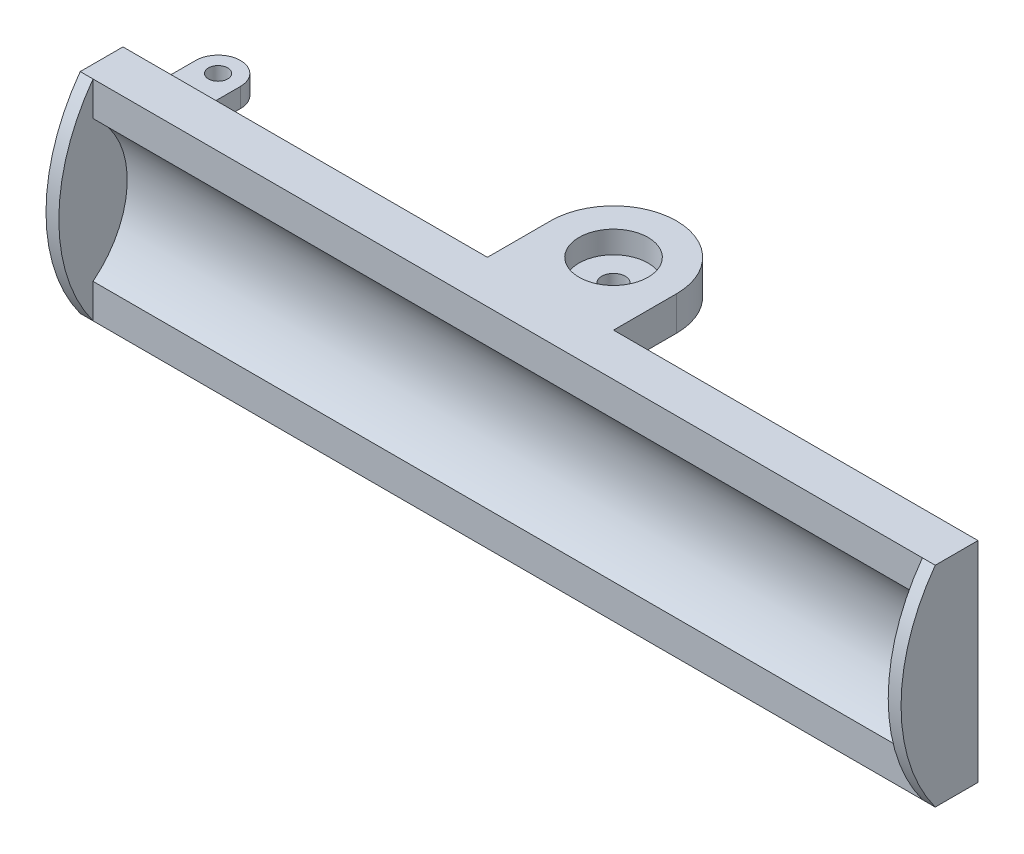
ISO-10303-21;
HEADER;
FILE_DESCRIPTION(('STEP AP214'),'2;1');
FILE_NAME('part.step','',(''),(''),'','','');
FILE_SCHEMA(('AUTOMOTIVE_DESIGN { 1 0 10303 214 1 1 1 1 }'));
ENDSEC;
DATA;
#1=APPLICATION_CONTEXT('core data for automotive mechanical design processes');
#2=APPLICATION_PROTOCOL_DEFINITION('international standard','automotive_design',2000,#1);
#3=PRODUCT_CONTEXT('',#1,'mechanical');
#4=PRODUCT('Part','Part','',(#3));
#5=PRODUCT_RELATED_PRODUCT_CATEGORY('part','',(#4));
#6=PRODUCT_DEFINITION_FORMATION('','',#4);
#7=PRODUCT_DEFINITION_CONTEXT('part definition',#1,'design');
#8=PRODUCT_DEFINITION('design','',#6,#7);
#9=PRODUCT_DEFINITION_SHAPE('','',#8);
#10=(LENGTH_UNIT() NAMED_UNIT(*) SI_UNIT(.MILLI.,.METRE.));
#11=(NAMED_UNIT(*) PLANE_ANGLE_UNIT() SI_UNIT($,.RADIAN.));
#12=(NAMED_UNIT(*) SI_UNIT($,.STERADIAN.) SOLID_ANGLE_UNIT());
#13=UNCERTAINTY_MEASURE_WITH_UNIT(LENGTH_MEASURE(1.E-05),#10,'distance_accuracy_value','');
#14=(GEOMETRIC_REPRESENTATION_CONTEXT(3) GLOBAL_UNCERTAINTY_ASSIGNED_CONTEXT((#13)) GLOBAL_UNIT_ASSIGNED_CONTEXT((#10,
#11,#12)) REPRESENTATION_CONTEXT('',''));
#15=CARTESIAN_POINT('',(0.,0.,0.));
#16=DIRECTION('',(0.,0.,1.));
#17=DIRECTION('',(1.,0.,0.));
#18=AXIS2_PLACEMENT_3D('',#15,#16,#17);
#19=CARTESIAN_POINT('',(100.,0.,18.));
#20=DIRECTION('',(-1.,0.,0.));
#21=DIRECTION('',(0.,0.,1.));
#22=AXIS2_PLACEMENT_3D('',#19,#20,#21);
#23=CYLINDRICAL_SURFACE('',#22,21.);
#24=DIRECTION('',(-1.,0.,0.));
#25=VECTOR('',#24,1.);
#26=CARTESIAN_POINT('',(100.,-16.4924225024707,5.));
#27=LINE('',#26,#25);
#28=CARTESIAN_POINT('',(97.,-16.4924225024707,5.));
#29=VERTEX_POINT('',#28);
#30=CARTESIAN_POINT('',(-97.,-16.4924225024707,5.));
#31=VERTEX_POINT('',#30);
#32=EDGE_CURVE('E53',#29,#31,#27,.T.);
#33=ORIENTED_EDGE('',*,*,#32,.F.);
#34=CARTESIAN_POINT('',(97.,0.,18.));
#35=DIRECTION('',(1.,0.,0.));
#36=DIRECTION('',(0.,0.,-1.));
#37=AXIS2_PLACEMENT_3D('',#34,#35,#36);
#38=CIRCLE('',#37,21.);
#39=CARTESIAN_POINT('',(97.,16.4924225024707,5.));
#40=VERTEX_POINT('',#39);
#41=EDGE_CURVE('E67',#29,#40,#38,.T.);
#42=ORIENTED_EDGE('',*,*,#41,.T.);
#43=DIRECTION('',(-1.,0.,0.));
#44=VECTOR('',#43,1.);
#45=CARTESIAN_POINT('',(100.,16.4924225024707,5.));
#46=LINE('',#45,#44);
#47=CARTESIAN_POINT('',(-97.,16.4924225024707,5.));
#48=VERTEX_POINT('',#47);
#49=EDGE_CURVE('E220',#40,#48,#46,.T.);
#50=ORIENTED_EDGE('',*,*,#49,.T.);
#51=CARTESIAN_POINT('',(-97.,0.,18.));
#52=DIRECTION('',(-1.,0.,0.));
#53=DIRECTION('',(0.,0.,1.));
#54=AXIS2_PLACEMENT_3D('',#51,#52,#53);
#55=CIRCLE('',#54,21.);
#56=EDGE_CURVE('E415',#48,#31,#55,.T.);
#57=ORIENTED_EDGE('',*,*,#56,.T.);
#58=EDGE_LOOP('',(#33,#42,#50,#57));
#59=FACE_BOUND('',#58,.T.);
#60=ADVANCED_FACE('F45',(#59),#23,.F.);
#61=CARTESIAN_POINT('',(100.,0.,5.));
#62=DIRECTION('',(0.,0.,1.));
#63=DIRECTION('',(1.,0.,0.));
#64=AXIS2_PLACEMENT_3D('',#61,#62,#63);
#65=PLANE('',#64);
#66=DIRECTION('',(-1.,0.,0.));
#67=VECTOR('',#66,1.);
#68=CARTESIAN_POINT('',(100.,-24.5,5.));
#69=LINE('',#68,#67);
#70=CARTESIAN_POINT('',(97.,-24.5,5.));
#71=VERTEX_POINT('',#70);
#72=CARTESIAN_POINT('',(-97.,-24.5,5.));
#73=VERTEX_POINT('',#72);
#74=EDGE_CURVE('E254',#71,#73,#69,.T.);
#75=ORIENTED_EDGE('',*,*,#74,.F.);
#76=DIRECTION('',(0.,1.,0.));
#77=VECTOR('',#76,1.);
#78=CARTESIAN_POINT('',(97.,0.,5.));
#79=LINE('',#78,#77);
#80=EDGE_CURVE('E60',#71,#29,#79,.T.);
#81=ORIENTED_EDGE('',*,*,#80,.T.);
#82=ORIENTED_EDGE('',*,*,#32,.T.);
#83=DIRECTION('',(0.,-1.,0.));
#84=VECTOR('',#83,1.);
#85=CARTESIAN_POINT('',(-97.,0.,5.));
#86=LINE('',#85,#84);
#87=EDGE_CURVE('E420',#31,#73,#86,.T.);
#88=ORIENTED_EDGE('',*,*,#87,.T.);
#89=EDGE_LOOP('',(#75,#81,#82,#88));
#90=FACE_BOUND('',#89,.T.);
#91=ADVANCED_FACE('F556',(#90),#65,.T.);
#92=ORIENTED_EDGE('',*,*,#49,.F.);
#93=DIRECTION('',(0.,1.,0.));
#94=VECTOR('',#93,1.);
#95=CARTESIAN_POINT('',(97.,0.,5.));
#96=LINE('',#95,#94);
#97=CARTESIAN_POINT('',(97.,24.5,5.));
#98=VERTEX_POINT('',#97);
#99=EDGE_CURVE('E223',#40,#98,#96,.T.);
#100=ORIENTED_EDGE('',*,*,#99,.T.);
#101=DIRECTION('',(-1.,0.,0.));
#102=VECTOR('',#101,1.);
#103=CARTESIAN_POINT('',(100.,24.5,5.));
#104=LINE('',#103,#102);
#105=CARTESIAN_POINT('',(-97.,24.5,5.));
#106=VERTEX_POINT('',#105);
#107=EDGE_CURVE('E206',#98,#106,#104,.T.);
#108=ORIENTED_EDGE('',*,*,#107,.T.);
#109=DIRECTION('',(0.,-1.,0.));
#110=VECTOR('',#109,1.);
#111=CARTESIAN_POINT('',(-97.,0.,5.));
#112=LINE('',#111,#110);
#113=EDGE_CURVE('E11',#106,#48,#112,.T.);
#114=ORIENTED_EDGE('',*,*,#113,.T.);
#115=EDGE_LOOP('',(#92,#100,#108,#114));
#116=FACE_BOUND('',#115,.T.);
#117=ADVANCED_FACE('F225',(#116),#65,.T.);
#118=CARTESIAN_POINT('',(0.,16.5,-19.75));
#119=DIRECTION('',(0.,1.,0.));
#120=DIRECTION('',(0.,0.,1.));
#121=AXIS2_PLACEMENT_3D('',#118,#119,#120);
#122=CYLINDRICAL_SURFACE('',#121,2.75);
#123=CARTESIAN_POINT('',(0.,16.5,-19.75));
#124=DIRECTION('',(0.,-1.,0.));
#125=DIRECTION('',(0.,0.,-1.));
#126=AXIS2_PLACEMENT_3D('',#123,#124,#125);
#127=CIRCLE('',#126,2.75);
#128=CARTESIAN_POINT('',(0.,16.5,-22.5));
#129=VERTEX_POINT('',#128);
#130=EDGE_CURVE('E294',#129,#129,#127,.T.);
#131=ORIENTED_EDGE('',*,*,#130,.T.);
#132=EDGE_LOOP('',(#131));
#133=FACE_BOUND('',#132,.T.);
#134=CARTESIAN_POINT('',(0.,19.3,-19.75));
#135=DIRECTION('',(0.,1.,0.));
#136=DIRECTION('',(0.,0.,1.));
#137=AXIS2_PLACEMENT_3D('',#134,#135,#136);
#138=CIRCLE('',#137,2.75);
#139=CARTESIAN_POINT('',(0.,19.3,-17.));
#140=VERTEX_POINT('',#139);
#141=EDGE_CURVE('E266',#140,#140,#138,.T.);
#142=ORIENTED_EDGE('',*,*,#141,.T.);
#143=EDGE_LOOP('',(#142));
#144=FACE_BOUND('',#143,.T.);
#145=ADVANCED_FACE('F610',(#133,#144),#122,.F.);
#146=CARTESIAN_POINT('',(100.,0.,-5.));
#147=DIRECTION('',(0.,0.,1.));
#148=DIRECTION('',(1.,0.,0.));
#149=AXIS2_PLACEMENT_3D('',#146,#147,#148);
#150=PLANE('',#149);
#151=DIRECTION('',(-1.,0.,0.));
#152=VECTOR('',#151,1.);
#153=CARTESIAN_POINT('',(100.,-24.5,-5.));
#154=LINE('',#153,#152);
#155=CARTESIAN_POINT('',(100.,-24.5,-5.));
#156=VERTEX_POINT('',#155);
#157=CARTESIAN_POINT('',(14.75,-24.5,-5.));
#158=VERTEX_POINT('',#157);
#159=EDGE_CURVE('E251',#156,#158,#154,.T.);
#160=ORIENTED_EDGE('',*,*,#159,.T.);
#161=DIRECTION('',(0.,-1.,0.));
#162=VECTOR('',#161,1.);
#163=CARTESIAN_POINT('',(14.75,-16.5,-5.));
#164=LINE('',#163,#162);
#165=CARTESIAN_POINT('',(14.75,-16.5,-5.));
#166=VERTEX_POINT('',#165);
#167=EDGE_CURVE('E375',#166,#158,#164,.T.);
#168=ORIENTED_EDGE('',*,*,#167,.F.);
#169=DIRECTION('',(1.,0.,0.));
#170=VECTOR('',#169,1.);
#171=CARTESIAN_POINT('',(0.,-16.5,-5.));
#172=LINE('',#171,#170);
#173=CARTESIAN_POINT('',(-14.75,-16.5,-5.));
#174=VERTEX_POINT('',#173);
#175=EDGE_CURVE('E352',#174,#166,#172,.T.);
#176=ORIENTED_EDGE('',*,*,#175,.F.);
#177=DIRECTION('',(0.,-1.,0.));
#178=VECTOR('',#177,1.);
#179=CARTESIAN_POINT('',(-14.75,-16.5,-5.));
#180=LINE('',#179,#178);
#181=CARTESIAN_POINT('',(-14.75,-24.5,-5.));
#182=VERTEX_POINT('',#181);
#183=EDGE_CURVE('E371',#174,#182,#180,.T.);
#184=ORIENTED_EDGE('',*,*,#183,.T.);
#185=CARTESIAN_POINT('',(-100.,-24.5,-5.));
#186=VERTEX_POINT('',#185);
#187=EDGE_CURVE('E250',#182,#186,#154,.T.);
#188=ORIENTED_EDGE('',*,*,#187,.T.);
#189=DIRECTION('',(0.,1.,0.));
#190=VECTOR('',#189,1.);
#191=CARTESIAN_POINT('',(-100.,0.,-5.));
#192=LINE('',#191,#190);
#193=CARTESIAN_POINT('',(-100.,24.5,-5.));
#194=VERTEX_POINT('',#193);
#195=EDGE_CURVE('E394',#186,#194,#192,.T.);
#196=ORIENTED_EDGE('',*,*,#195,.T.);
#197=DIRECTION('',(-1.,0.,0.));
#198=VECTOR('',#197,1.);
#199=CARTESIAN_POINT('',(100.,24.5,-5.));
#200=LINE('',#199,#198);
#201=CARTESIAN_POINT('',(-14.75,24.5,-5.));
#202=VERTEX_POINT('',#201);
#203=EDGE_CURVE('E240',#202,#194,#200,.T.);
#204=ORIENTED_EDGE('',*,*,#203,.F.);
#205=DIRECTION('',(0.,1.,0.));
#206=VECTOR('',#205,1.);
#207=CARTESIAN_POINT('',(-14.75,16.5,-5.));
#208=LINE('',#207,#206);
#209=CARTESIAN_POINT('',(-14.75,16.5,-5.));
#210=VERTEX_POINT('',#209);
#211=EDGE_CURVE('E327',#210,#202,#208,.T.);
#212=ORIENTED_EDGE('',*,*,#211,.F.);
#213=DIRECTION('',(1.,0.,0.));
#214=VECTOR('',#213,1.);
#215=CARTESIAN_POINT('',(0.,16.5,-5.));
#216=LINE('',#215,#214);
#217=CARTESIAN_POINT('',(14.75,16.5,-5.));
#218=VERTEX_POINT('',#217);
#219=EDGE_CURVE('E307',#210,#218,#216,.T.);
#220=ORIENTED_EDGE('',*,*,#219,.T.);
#221=DIRECTION('',(0.,1.,0.));
#222=VECTOR('',#221,1.);
#223=CARTESIAN_POINT('',(14.75,16.5,-5.));
#224=LINE('',#223,#222);
#225=CARTESIAN_POINT('',(14.75,24.5,-5.));
#226=VERTEX_POINT('',#225);
#227=EDGE_CURVE('E323',#218,#226,#224,.T.);
#228=ORIENTED_EDGE('',*,*,#227,.T.);
#229=CARTESIAN_POINT('',(100.,24.5,-5.));
#230=VERTEX_POINT('',#229);
#231=EDGE_CURVE('E244',#230,#226,#200,.T.);
#232=ORIENTED_EDGE('',*,*,#231,.F.);
#233=DIRECTION('',(0.,1.,0.));
#234=VECTOR('',#233,1.);
#235=CARTESIAN_POINT('',(100.,0.,-5.));
#236=LINE('',#235,#234);
#237=EDGE_CURVE('E384',#156,#230,#236,.T.);
#238=ORIENTED_EDGE('',*,*,#237,.F.);
#239=EDGE_LOOP('',(#160,#168,#176,#184,#188,#196,#204,#212,#220,#228,#232,#238));
#240=FACE_BOUND('',#239,.T.);
#241=DIRECTION('',(0.,1.,0.));
#242=VECTOR('',#241,1.);
#243=CARTESIAN_POINT('',(-87.25,-15.5,-5.));
#244=LINE('',#243,#242);
#245=CARTESIAN_POINT('',(-87.25,-15.5,-5.));
#246=VERTEX_POINT('',#245);
#247=CARTESIAN_POINT('',(-87.25,-11.,-5.));
#248=VERTEX_POINT('',#247);
#249=EDGE_CURVE('E519',#246,#248,#244,.T.);
#250=ORIENTED_EDGE('',*,*,#249,.T.);
#251=DIRECTION('',(1.,0.,0.));
#252=VECTOR('',#251,1.);
#253=CARTESIAN_POINT('',(0.,-11.,-5.));
#254=LINE('',#253,#252);
#255=CARTESIAN_POINT('',(-97.75,-11.,-5.));
#256=VERTEX_POINT('',#255);
#257=EDGE_CURVE('E483',#256,#248,#254,.T.);
#258=ORIENTED_EDGE('',*,*,#257,.F.);
#259=DIRECTION('',(0.,1.,0.));
#260=VECTOR('',#259,1.);
#261=CARTESIAN_POINT('',(-97.75,-15.5,-5.));
#262=LINE('',#261,#260);
#263=CARTESIAN_POINT('',(-97.75,-15.5,-5.));
#264=VERTEX_POINT('',#263);
#265=EDGE_CURVE('E498',#264,#256,#262,.T.);
#266=ORIENTED_EDGE('',*,*,#265,.F.);
#267=DIRECTION('',(1.,0.,0.));
#268=VECTOR('',#267,1.);
#269=CARTESIAN_POINT('',(0.,-15.5,-5.));
#270=LINE('',#269,#268);
#271=EDGE_CURVE('E495',#264,#246,#270,.T.);
#272=ORIENTED_EDGE('',*,*,#271,.T.);
#273=EDGE_LOOP('',(#250,#258,#266,#272));
#274=FACE_BOUND('',#273,.T.);
#275=DIRECTION('',(0.,-1.,0.));
#276=VECTOR('',#275,1.);
#277=CARTESIAN_POINT('',(-87.25,15.5,-5.));
#278=LINE('',#277,#276);
#279=CARTESIAN_POINT('',(-87.25,15.5,-5.));
#280=VERTEX_POINT('',#279);
#281=CARTESIAN_POINT('',(-87.25,11.,-5.));
#282=VERTEX_POINT('',#281);
#283=EDGE_CURVE('E470',#280,#282,#278,.T.);
#284=ORIENTED_EDGE('',*,*,#283,.F.);
#285=DIRECTION('',(1.,0.,0.));
#286=VECTOR('',#285,1.);
#287=CARTESIAN_POINT('',(0.,15.5,-5.));
#288=LINE('',#287,#286);
#289=CARTESIAN_POINT('',(-97.75,15.5,-5.));
#290=VERTEX_POINT('',#289);
#291=EDGE_CURVE('E438',#290,#280,#288,.T.);
#292=ORIENTED_EDGE('',*,*,#291,.F.);
#293=DIRECTION('',(0.,-1.,0.));
#294=VECTOR('',#293,1.);
#295=CARTESIAN_POINT('',(-97.75,15.5,-5.));
#296=LINE('',#295,#294);
#297=CARTESIAN_POINT('',(-97.75,11.,-5.));
#298=VERTEX_POINT('',#297);
#299=EDGE_CURVE('E474',#290,#298,#296,.T.);
#300=ORIENTED_EDGE('',*,*,#299,.T.);
#301=DIRECTION('',(1.,0.,0.));
#302=VECTOR('',#301,1.);
#303=CARTESIAN_POINT('',(0.,11.,-5.));
#304=LINE('',#303,#302);
#305=EDGE_CURVE('E456',#298,#282,#304,.T.);
#306=ORIENTED_EDGE('',*,*,#305,.T.);
#307=EDGE_LOOP('',(#284,#292,#300,#306));
#308=FACE_BOUND('',#307,.T.);
#309=ADVANCED_FACE('F540',(#240,#274,#308),#150,.F.);
#310=CARTESIAN_POINT('',(0.,-16.5,-19.75));
#311=DIRECTION('',(0.,-1.,0.));
#312=DIRECTION('',(0.,0.,-1.));
#313=AXIS2_PLACEMENT_3D('',#310,#311,#312);
#314=CYLINDRICAL_SURFACE('',#313,2.75);
#315=CARTESIAN_POINT('',(0.,-16.5,-19.75));
#316=DIRECTION('',(0.,-1.,0.));
#317=DIRECTION('',(0.,0.,-1.));
#318=AXIS2_PLACEMENT_3D('',#315,#316,#317);
#319=CIRCLE('',#318,2.75);
#320=CARTESIAN_POINT('',(0.,-16.5,-22.5));
#321=VERTEX_POINT('',#320);
#322=EDGE_CURVE('E339',#321,#321,#319,.T.);
#323=ORIENTED_EDGE('',*,*,#322,.F.);
#324=EDGE_LOOP('',(#323));
#325=FACE_BOUND('',#324,.T.);
#326=CARTESIAN_POINT('',(0.,-19.3,-19.75));
#327=DIRECTION('',(0.,-1.,0.));
#328=DIRECTION('',(0.,0.,-1.));
#329=AXIS2_PLACEMENT_3D('',#326,#327,#328);
#330=CIRCLE('',#329,2.75);
#331=CARTESIAN_POINT('',(0.,-19.3,-22.5));
#332=VERTEX_POINT('',#331);
#333=EDGE_CURVE('E261',#332,#332,#330,.F.);
#334=ORIENTED_EDGE('',*,*,#333,.F.);
#335=EDGE_LOOP('',(#334));
#336=FACE_BOUND('',#335,.T.);
#337=ADVANCED_FACE('F633',(#325,#336),#314,.F.);
#338=CARTESIAN_POINT('',(100.,-24.5,0.));
#339=DIRECTION('',(0.,-1.,0.));
#340=DIRECTION('',(0.,0.,-1.));
#341=AXIS2_PLACEMENT_3D('',#338,#339,#340);
#342=PLANE('',#341);
#343=CARTESIAN_POINT('',(100.,-24.5,5.));
#344=VERTEX_POINT('',#343);
#345=EDGE_CURVE('E255',#344,#71,#69,.T.);
#346=ORIENTED_EDGE('',*,*,#345,.T.);
#347=ORIENTED_EDGE('',*,*,#74,.T.);
#348=DIRECTION('',(-1.,0.,0.));
#349=VECTOR('',#348,1.);
#350=CARTESIAN_POINT('',(-97.,-24.5,5.));
#351=LINE('',#350,#349);
#352=CARTESIAN_POINT('',(-100.,-24.5,5.));
#353=VERTEX_POINT('',#352);
#354=EDGE_CURVE('E416',#73,#353,#351,.T.);
#355=ORIENTED_EDGE('',*,*,#354,.T.);
#356=DIRECTION('',(0.,0.,1.));
#357=VECTOR('',#356,1.);
#358=CARTESIAN_POINT('',(-100.,-24.5,0.));
#359=LINE('',#358,#357);
#360=EDGE_CURVE('E370',#186,#353,#359,.T.);
#361=ORIENTED_EDGE('',*,*,#360,.F.);
#362=ORIENTED_EDGE('',*,*,#187,.F.);
#363=DIRECTION('',(0.,0.,1.));
#364=VECTOR('',#363,1.);
#365=CARTESIAN_POINT('',(-14.75,-24.5,0.));
#366=LINE('',#365,#364);
#367=CARTESIAN_POINT('',(-14.75,-24.5,-19.75));
#368=VERTEX_POINT('',#367);
#369=EDGE_CURVE('E344',#368,#182,#366,.T.);
#370=ORIENTED_EDGE('',*,*,#369,.F.);
#371=CARTESIAN_POINT('',(0.,-24.5,-19.75));
#372=DIRECTION('',(0.,-1.,0.));
#373=DIRECTION('',(0.,0.,-1.));
#374=AXIS2_PLACEMENT_3D('',#371,#372,#373);
#375=CIRCLE('',#374,14.75);
#376=CARTESIAN_POINT('',(14.75,-24.5,-19.75));
#377=VERTEX_POINT('',#376);
#378=EDGE_CURVE('E264',#368,#377,#375,.T.);
#379=ORIENTED_EDGE('',*,*,#378,.T.);
#380=DIRECTION('',(0.,0.,1.));
#381=VECTOR('',#380,1.);
#382=CARTESIAN_POINT('',(14.75,-24.5,0.));
#383=LINE('',#382,#381);
#384=EDGE_CURVE('E362',#377,#158,#383,.T.);
#385=ORIENTED_EDGE('',*,*,#384,.T.);
#386=ORIENTED_EDGE('',*,*,#159,.F.);
#387=DIRECTION('',(0.,0.,1.));
#388=VECTOR('',#387,1.);
#389=CARTESIAN_POINT('',(100.,-24.5,0.));
#390=LINE('',#389,#388);
#391=EDGE_CURVE('E381',#156,#344,#390,.T.);
#392=ORIENTED_EDGE('',*,*,#391,.T.);
#393=EDGE_LOOP('',(#346,#347,#355,#361,#362,#370,#379,#385,#386,#392));
#394=FACE_BOUND('',#393,.T.);
#395=CARTESIAN_POINT('',(0.,-24.5,-19.75));
#396=DIRECTION('',(0.,-1.,0.));
#397=DIRECTION('',(0.,0.,-1.));
#398=AXIS2_PLACEMENT_3D('',#395,#396,#397);
#399=CIRCLE('',#398,8.075);
#400=CARTESIAN_POINT('',(0.,-24.5,-27.825));
#401=VERTEX_POINT('',#400);
#402=EDGE_CURVE('E322',#401,#401,#399,.T.);
#403=ORIENTED_EDGE('',*,*,#402,.F.);
#404=EDGE_LOOP('',(#403));
#405=FACE_BOUND('',#404,.T.);
#406=ADVANCED_FACE('F575',(#394,#405),#342,.T.);
#407=CARTESIAN_POINT('',(100.,24.5,0.));
#408=DIRECTION('',(0.,-1.,0.));
#409=DIRECTION('',(0.,0.,-1.));
#410=AXIS2_PLACEMENT_3D('',#407,#408,#409);
#411=PLANE('',#410);
#412=ORIENTED_EDGE('',*,*,#231,.T.);
#413=DIRECTION('',(0.,0.,1.));
#414=VECTOR('',#413,1.);
#415=CARTESIAN_POINT('',(14.75,24.5,0.));
#416=LINE('',#415,#414);
#417=CARTESIAN_POINT('',(14.75,24.5,-19.75));
#418=VERTEX_POINT('',#417);
#419=EDGE_CURVE('E299',#418,#226,#416,.T.);
#420=ORIENTED_EDGE('',*,*,#419,.F.);
#421=CARTESIAN_POINT('',(0.,24.5,-19.75));
#422=DIRECTION('',(0.,-1.,0.));
#423=DIRECTION('',(0.,0.,-1.));
#424=AXIS2_PLACEMENT_3D('',#421,#422,#423);
#425=CIRCLE('',#424,14.75);
#426=CARTESIAN_POINT('',(-14.75,24.5,-19.75));
#427=VERTEX_POINT('',#426);
#428=EDGE_CURVE('E269',#427,#418,#425,.T.);
#429=ORIENTED_EDGE('',*,*,#428,.F.);
#430=DIRECTION('',(0.,0.,1.));
#431=VECTOR('',#430,1.);
#432=CARTESIAN_POINT('',(-14.75,24.5,0.));
#433=LINE('',#432,#431);
#434=EDGE_CURVE('E277',#427,#202,#433,.T.);
#435=ORIENTED_EDGE('',*,*,#434,.T.);
#436=ORIENTED_EDGE('',*,*,#203,.T.);
#437=DIRECTION('',(0.,0.,1.));
#438=VECTOR('',#437,1.);
#439=CARTESIAN_POINT('',(-100.,24.5,0.));
#440=LINE('',#439,#438);
#441=CARTESIAN_POINT('',(-100.,24.5,5.));
#442=VERTEX_POINT('',#441);
#443=EDGE_CURVE('E385',#194,#442,#440,.T.);
#444=ORIENTED_EDGE('',*,*,#443,.T.);
#445=DIRECTION('',(-1.,0.,0.));
#446=VECTOR('',#445,1.);
#447=CARTESIAN_POINT('',(-97.,24.5,5.));
#448=LINE('',#447,#446);
#449=EDGE_CURVE('E216',#106,#442,#448,.T.);
#450=ORIENTED_EDGE('',*,*,#449,.F.);
#451=ORIENTED_EDGE('',*,*,#107,.F.);
#452=CARTESIAN_POINT('',(100.,24.5,5.));
#453=VERTEX_POINT('',#452);
#454=EDGE_CURVE('E212',#453,#98,#104,.T.);
#455=ORIENTED_EDGE('',*,*,#454,.F.);
#456=DIRECTION('',(0.,0.,1.));
#457=VECTOR('',#456,1.);
#458=CARTESIAN_POINT('',(100.,24.5,0.));
#459=LINE('',#458,#457);
#460=EDGE_CURVE('E388',#230,#453,#459,.T.);
#461=ORIENTED_EDGE('',*,*,#460,.F.);
#462=EDGE_LOOP('',(#412,#420,#429,#435,#436,#444,#450,#451,#455,#461));
#463=FACE_BOUND('',#462,.T.);
#464=CARTESIAN_POINT('',(0.,24.5,-19.75));
#465=DIRECTION('',(0.,-1.,0.));
#466=DIRECTION('',(0.,0.,-1.));
#467=AXIS2_PLACEMENT_3D('',#464,#465,#466);
#468=CIRCLE('',#467,8.075);
#469=CARTESIAN_POINT('',(0.,24.5,-27.825));
#470=VERTEX_POINT('',#469);
#471=EDGE_CURVE('E281',#470,#470,#468,.T.);
#472=ORIENTED_EDGE('',*,*,#471,.T.);
#473=EDGE_LOOP('',(#472));
#474=FACE_BOUND('',#473,.T.);
#475=ADVANCED_FACE('F208',(#463,#474),#411,.F.);
#476=CARTESIAN_POINT('',(100.,0.,0.));
#477=DIRECTION('',(1.,0.,0.));
#478=DIRECTION('',(0.,0.,-1.));
#479=AXIS2_PLACEMENT_3D('',#476,#477,#478);
#480=PLANE('',#479);
#481=CARTESIAN_POINT('',(100.,0.,-28.515625));
#482=DIRECTION('',(-1.,0.,0.));
#483=DIRECTION('',(0.,0.,1.));
#484=AXIS2_PLACEMENT_3D('',#481,#482,#483);
#485=CIRCLE('',#484,41.515625);
#486=EDGE_CURVE('E235',#344,#453,#485,.T.);
#487=ORIENTED_EDGE('',*,*,#486,.F.);
#488=ORIENTED_EDGE('',*,*,#391,.F.);
#489=ORIENTED_EDGE('',*,*,#237,.T.);
#490=ORIENTED_EDGE('',*,*,#460,.T.);
#491=EDGE_LOOP('',(#487,#488,#489,#490));
#492=FACE_BOUND('',#491,.T.);
#493=ADVANCED_FACE('F580',(#492),#480,.T.);
#494=CARTESIAN_POINT('',(-100.,0.,0.));
#495=DIRECTION('',(1.,0.,0.));
#496=DIRECTION('',(0.,0.,-1.));
#497=AXIS2_PLACEMENT_3D('',#494,#495,#496);
#498=PLANE('',#497);
#499=ORIENTED_EDGE('',*,*,#360,.T.);
#500=CARTESIAN_POINT('',(-100.,0.,-28.515625));
#501=DIRECTION('',(-1.,0.,0.));
#502=DIRECTION('',(0.,0.,1.));
#503=AXIS2_PLACEMENT_3D('',#500,#501,#502);
#504=CIRCLE('',#503,41.515625);
#505=EDGE_CURVE('E404',#353,#442,#504,.T.);
#506=ORIENTED_EDGE('',*,*,#505,.T.);
#507=ORIENTED_EDGE('',*,*,#443,.F.);
#508=ORIENTED_EDGE('',*,*,#195,.F.);
#509=EDGE_LOOP('',(#499,#506,#507,#508));
#510=FACE_BOUND('',#509,.T.);
#511=ADVANCED_FACE('F402',(#510),#498,.F.);
#512=CARTESIAN_POINT('',(0.,-16.5,-19.75));
#513=DIRECTION('',(0.,-1.,0.));
#514=DIRECTION('',(0.,0.,-1.));
#515=AXIS2_PLACEMENT_3D('',#512,#513,#514);
#516=CYLINDRICAL_SURFACE('',#515,14.75);
#517=ORIENTED_EDGE('',*,*,#378,.F.);
#518=DIRECTION('',(0.,-1.,0.));
#519=VECTOR('',#518,1.);
#520=CARTESIAN_POINT('',(-14.75,-16.5,-19.75));
#521=LINE('',#520,#519);
#522=CARTESIAN_POINT('',(-14.75,-16.5,-19.75));
#523=VERTEX_POINT('',#522);
#524=EDGE_CURVE('E367',#523,#368,#521,.T.);
#525=ORIENTED_EDGE('',*,*,#524,.F.);
#526=CARTESIAN_POINT('',(0.,-16.5,-19.75));
#527=DIRECTION('',(0.,-1.,0.));
#528=DIRECTION('',(0.,0.,-1.));
#529=AXIS2_PLACEMENT_3D('',#526,#527,#528);
#530=CIRCLE('',#529,14.75);
#531=CARTESIAN_POINT('',(14.75,-16.5,-19.75));
#532=VERTEX_POINT('',#531);
#533=EDGE_CURVE('E343',#523,#532,#530,.T.);
#534=ORIENTED_EDGE('',*,*,#533,.T.);
#535=DIRECTION('',(0.,-1.,0.));
#536=VECTOR('',#535,1.);
#537=CARTESIAN_POINT('',(14.75,-16.5,-19.75));
#538=LINE('',#537,#536);
#539=EDGE_CURVE('E358',#532,#377,#538,.T.);
#540=ORIENTED_EDGE('',*,*,#539,.T.);
#541=EDGE_LOOP('',(#517,#525,#534,#540));
#542=FACE_BOUND('',#541,.T.);
#543=ADVANCED_FACE('F625',(#542),#516,.T.);
#544=CARTESIAN_POINT('',(-14.75,-16.5,0.));
#545=DIRECTION('',(1.,0.,0.));
#546=DIRECTION('',(0.,0.,-1.));
#547=AXIS2_PLACEMENT_3D('',#544,#545,#546);
#548=PLANE('',#547);
#549=ORIENTED_EDGE('',*,*,#369,.T.);
#550=ORIENTED_EDGE('',*,*,#183,.F.);
#551=DIRECTION('',(0.,0.,1.));
#552=VECTOR('',#551,1.);
#553=CARTESIAN_POINT('',(-14.75,-16.5,0.));
#554=LINE('',#553,#552);
#555=EDGE_CURVE('E355',#523,#174,#554,.T.);
#556=ORIENTED_EDGE('',*,*,#555,.F.);
#557=ORIENTED_EDGE('',*,*,#524,.T.);
#558=EDGE_LOOP('',(#549,#550,#556,#557));
#559=FACE_BOUND('',#558,.T.);
#560=ADVANCED_FACE('F622',(#559),#548,.F.);
#561=CARTESIAN_POINT('',(14.75,-16.5,0.));
#562=DIRECTION('',(1.,0.,0.));
#563=DIRECTION('',(0.,0.,-1.));
#564=AXIS2_PLACEMENT_3D('',#561,#562,#563);
#565=PLANE('',#564);
#566=ORIENTED_EDGE('',*,*,#384,.F.);
#567=ORIENTED_EDGE('',*,*,#539,.F.);
#568=DIRECTION('',(0.,0.,1.));
#569=VECTOR('',#568,1.);
#570=CARTESIAN_POINT('',(14.75,-16.5,0.));
#571=LINE('',#570,#569);
#572=EDGE_CURVE('E348',#532,#166,#571,.T.);
#573=ORIENTED_EDGE('',*,*,#572,.T.);
#574=ORIENTED_EDGE('',*,*,#167,.T.);
#575=EDGE_LOOP('',(#566,#567,#573,#574));
#576=FACE_BOUND('',#575,.T.);
#577=ADVANCED_FACE('F620',(#576),#565,.T.);
#578=CARTESIAN_POINT('',(0.,-16.5,0.));
#579=DIRECTION('',(0.,-1.,0.));
#580=DIRECTION('',(0.,0.,-1.));
#581=AXIS2_PLACEMENT_3D('',#578,#579,#580);
#582=PLANE('',#581);
#583=ORIENTED_EDGE('',*,*,#322,.T.);
#584=EDGE_LOOP('',(#583));
#585=FACE_BOUND('',#584,.T.);
#586=ORIENTED_EDGE('',*,*,#533,.F.);
#587=ORIENTED_EDGE('',*,*,#555,.T.);
#588=ORIENTED_EDGE('',*,*,#175,.T.);
#589=ORIENTED_EDGE('',*,*,#572,.F.);
#590=EDGE_LOOP('',(#586,#587,#588,#589));
#591=FACE_BOUND('',#590,.T.);
#592=ADVANCED_FACE('F615',(#585,#591),#582,.F.);
#593=CARTESIAN_POINT('',(0.,-19.3,-19.75));
#594=DIRECTION('',(0.,-1.,0.));
#595=DIRECTION('',(0.,0.,-1.));
#596=AXIS2_PLACEMENT_3D('',#593,#594,#595);
#597=PLANE('',#596);
#598=CARTESIAN_POINT('',(0.,-19.3,-19.75));
#599=DIRECTION('',(0.,-1.,0.));
#600=DIRECTION('',(0.,0.,-1.));
#601=AXIS2_PLACEMENT_3D('',#598,#599,#600);
#602=CIRCLE('',#601,8.075);
#603=CARTESIAN_POINT('',(0.,-19.3,-27.825));
#604=VERTEX_POINT('',#603);
#605=EDGE_CURVE('E265',#604,#604,#602,.T.);
#606=ORIENTED_EDGE('',*,*,#605,.T.);
#607=EDGE_LOOP('',(#606));
#608=FACE_BOUND('',#607,.T.);
#609=ORIENTED_EDGE('',*,*,#333,.T.);
#610=EDGE_LOOP('',(#609));
#611=FACE_BOUND('',#610,.T.);
#612=ADVANCED_FACE('F605',(#608,#611),#597,.T.);
#613=CARTESIAN_POINT('',(0.,-19.3,-19.75));
#614=DIRECTION('',(0.,-1.,0.));
#615=DIRECTION('',(0.,0.,-1.));
#616=AXIS2_PLACEMENT_3D('',#613,#614,#615);
#617=CYLINDRICAL_SURFACE('',#616,8.075);
#618=ORIENTED_EDGE('',*,*,#605,.F.);
#619=EDGE_LOOP('',(#618));
#620=FACE_BOUND('',#619,.T.);
#621=ORIENTED_EDGE('',*,*,#402,.T.);
#622=EDGE_LOOP('',(#621));
#623=FACE_BOUND('',#622,.T.);
#624=ADVANCED_FACE('F599',(#620,#623),#617,.F.);
#625=CARTESIAN_POINT('',(0.,16.5,-19.75));
#626=DIRECTION('',(0.,1.,0.));
#627=DIRECTION('',(0.,0.,1.));
#628=AXIS2_PLACEMENT_3D('',#625,#626,#627);
#629=CYLINDRICAL_SURFACE('',#628,14.75);
#630=ORIENTED_EDGE('',*,*,#428,.T.);
#631=DIRECTION('',(0.,1.,0.));
#632=VECTOR('',#631,1.);
#633=CARTESIAN_POINT('',(14.75,16.5,-19.75));
#634=LINE('',#633,#632);
#635=CARTESIAN_POINT('',(14.75,16.5,-19.75));
#636=VERTEX_POINT('',#635);
#637=EDGE_CURVE('E318',#636,#418,#634,.T.);
#638=ORIENTED_EDGE('',*,*,#637,.F.);
#639=CARTESIAN_POINT('',(0.,16.5,-19.75));
#640=DIRECTION('',(0.,-1.,0.));
#641=DIRECTION('',(0.,0.,-1.));
#642=AXIS2_PLACEMENT_3D('',#639,#640,#641);
#643=CIRCLE('',#642,14.75);
#644=CARTESIAN_POINT('',(-14.75,16.5,-19.75));
#645=VERTEX_POINT('',#644);
#646=EDGE_CURVE('E298',#645,#636,#643,.T.);
#647=ORIENTED_EDGE('',*,*,#646,.F.);
#648=DIRECTION('',(0.,1.,0.));
#649=VECTOR('',#648,1.);
#650=CARTESIAN_POINT('',(-14.75,16.5,-19.75));
#651=LINE('',#650,#649);
#652=EDGE_CURVE('E312',#645,#427,#651,.T.);
#653=ORIENTED_EDGE('',*,*,#652,.T.);
#654=EDGE_LOOP('',(#630,#638,#647,#653));
#655=FACE_BOUND('',#654,.T.);
#656=ADVANCED_FACE('F597',(#655),#629,.T.);
#657=CARTESIAN_POINT('',(14.75,16.5,0.));
#658=DIRECTION('',(-1.,0.,0.));
#659=DIRECTION('',(0.,0.,1.));
#660=AXIS2_PLACEMENT_3D('',#657,#658,#659);
#661=PLANE('',#660);
#662=ORIENTED_EDGE('',*,*,#419,.T.);
#663=ORIENTED_EDGE('',*,*,#227,.F.);
#664=DIRECTION('',(0.,0.,1.));
#665=VECTOR('',#664,1.);
#666=CARTESIAN_POINT('',(14.75,16.5,0.));
#667=LINE('',#666,#665);
#668=EDGE_CURVE('E310',#636,#218,#667,.T.);
#669=ORIENTED_EDGE('',*,*,#668,.F.);
#670=ORIENTED_EDGE('',*,*,#637,.T.);
#671=EDGE_LOOP('',(#662,#663,#669,#670));
#672=FACE_BOUND('',#671,.T.);
#673=ADVANCED_FACE('F586',(#672),#661,.F.);
#674=CARTESIAN_POINT('',(-14.75,16.5,0.));
#675=DIRECTION('',(-1.,0.,0.));
#676=DIRECTION('',(0.,0.,1.));
#677=AXIS2_PLACEMENT_3D('',#674,#675,#676);
#678=PLANE('',#677);
#679=ORIENTED_EDGE('',*,*,#434,.F.);
#680=ORIENTED_EDGE('',*,*,#652,.F.);
#681=DIRECTION('',(0.,0.,1.));
#682=VECTOR('',#681,1.);
#683=CARTESIAN_POINT('',(-14.75,16.5,0.));
#684=LINE('',#683,#682);
#685=EDGE_CURVE('E303',#645,#210,#684,.T.);
#686=ORIENTED_EDGE('',*,*,#685,.T.);
#687=ORIENTED_EDGE('',*,*,#211,.T.);
#688=EDGE_LOOP('',(#679,#680,#686,#687));
#689=FACE_BOUND('',#688,.T.);
#690=ADVANCED_FACE('F594',(#689),#678,.T.);
#691=CARTESIAN_POINT('',(0.,16.5,0.));
#692=DIRECTION('',(0.,1.,0.));
#693=DIRECTION('',(0.,0.,-1.));
#694=AXIS2_PLACEMENT_3D('',#691,#692,#693);
#695=PLANE('',#694);
#696=ORIENTED_EDGE('',*,*,#130,.F.);
#697=EDGE_LOOP('',(#696));
#698=FACE_BOUND('',#697,.T.);
#699=ORIENTED_EDGE('',*,*,#646,.T.);
#700=ORIENTED_EDGE('',*,*,#668,.T.);
#701=ORIENTED_EDGE('',*,*,#219,.F.);
#702=ORIENTED_EDGE('',*,*,#685,.F.);
#703=EDGE_LOOP('',(#699,#700,#701,#702));
#704=FACE_BOUND('',#703,.T.);
#705=ADVANCED_FACE('F591',(#698,#704),#695,.F.);
#706=CARTESIAN_POINT('',(0.,19.3,-19.75));
#707=DIRECTION('',(0.,1.,0.));
#708=DIRECTION('',(0.,0.,1.));
#709=AXIS2_PLACEMENT_3D('',#706,#707,#708);
#710=CYLINDRICAL_SURFACE('',#709,8.075);
#711=CARTESIAN_POINT('',(0.,19.3,-19.75));
#712=DIRECTION('',(0.,-1.,0.));
#713=DIRECTION('',(0.,0.,-1.));
#714=AXIS2_PLACEMENT_3D('',#711,#712,#713);
#715=CIRCLE('',#714,8.075);
#716=CARTESIAN_POINT('',(0.,19.3,-27.825));
#717=VERTEX_POINT('',#716);
#718=EDGE_CURVE('E270',#717,#717,#715,.T.);
#719=ORIENTED_EDGE('',*,*,#718,.T.);
#720=EDGE_LOOP('',(#719));
#721=FACE_BOUND('',#720,.T.);
#722=ORIENTED_EDGE('',*,*,#471,.F.);
#723=EDGE_LOOP('',(#722));
#724=FACE_BOUND('',#723,.T.);
#725=ADVANCED_FACE('F716',(#721,#724),#710,.F.);
#726=CARTESIAN_POINT('',(0.,19.3,-19.75));
#727=DIRECTION('',(0.,1.,0.));
#728=DIRECTION('',(0.,0.,-1.));
#729=AXIS2_PLACEMENT_3D('',#726,#727,#728);
#730=PLANE('',#729);
#731=ORIENTED_EDGE('',*,*,#141,.F.);
#732=EDGE_LOOP('',(#731));
#733=FACE_BOUND('',#732,.T.);
#734=ORIENTED_EDGE('',*,*,#718,.F.);
#735=EDGE_LOOP('',(#734));
#736=FACE_BOUND('',#735,.T.);
#737=ADVANCED_FACE('F726',(#733,#736),#730,.T.);
#738=CARTESIAN_POINT('',(-97.75,-15.5,0.));
#739=DIRECTION('',(-1.,0.,0.));
#740=DIRECTION('',(0.,0.,1.));
#741=AXIS2_PLACEMENT_3D('',#738,#739,#740);
#742=PLANE('',#741);
#743=DIRECTION('',(0.,0.,1.));
#744=VECTOR('',#743,1.);
#745=CARTESIAN_POINT('',(-97.75,-11.,0.));
#746=LINE('',#745,#744);
#747=CARTESIAN_POINT('',(-97.75,-11.,-19.75));
#748=VERTEX_POINT('',#747);
#749=EDGE_CURVE('E502',#748,#256,#746,.T.);
#750=ORIENTED_EDGE('',*,*,#749,.F.);
#751=DIRECTION('',(0.,1.,0.));
#752=VECTOR('',#751,1.);
#753=CARTESIAN_POINT('',(-97.75,-15.5,-19.75));
#754=LINE('',#753,#752);
#755=CARTESIAN_POINT('',(-97.75,-15.5,-19.75));
#756=VERTEX_POINT('',#755);
#757=EDGE_CURVE('E289',#756,#748,#754,.T.);
#758=ORIENTED_EDGE('',*,*,#757,.F.);
#759=DIRECTION('',(0.,0.,1.));
#760=VECTOR('',#759,1.);
#761=CARTESIAN_POINT('',(-97.75,-15.5,0.));
#762=LINE('',#761,#760);
#763=EDGE_CURVE('E482',#756,#264,#762,.T.);
#764=ORIENTED_EDGE('',*,*,#763,.T.);
#765=ORIENTED_EDGE('',*,*,#265,.T.);
#766=EDGE_LOOP('',(#750,#758,#764,#765));
#767=FACE_BOUND('',#766,.T.);
#768=ADVANCED_FACE('F537',(#767),#742,.T.);
#769=CARTESIAN_POINT('',(-92.5,-15.5,-19.75));
#770=DIRECTION('',(0.,1.,0.));
#771=DIRECTION('',(0.,0.,1.));
#772=AXIS2_PLACEMENT_3D('',#769,#770,#771);
#773=CYLINDRICAL_SURFACE('',#772,5.25);
#774=CARTESIAN_POINT('',(-92.5,-11.,-19.75));
#775=DIRECTION('',(0.,-1.,0.));
#776=DIRECTION('',(0.,0.,-1.));
#777=AXIS2_PLACEMENT_3D('',#774,#775,#776);
#778=CIRCLE('',#777,5.25);
#779=CARTESIAN_POINT('',(-87.25,-11.,-19.75));
#780=VERTEX_POINT('',#779);
#781=EDGE_CURVE('E506',#748,#780,#778,.T.);
#782=ORIENTED_EDGE('',*,*,#781,.T.);
#783=DIRECTION('',(0.,1.,0.));
#784=VECTOR('',#783,1.);
#785=CARTESIAN_POINT('',(-87.25,-15.5,-19.75));
#786=LINE('',#785,#784);
#787=CARTESIAN_POINT('',(-87.25,-15.5,-19.75));
#788=VERTEX_POINT('',#787);
#789=EDGE_CURVE('E522',#788,#780,#786,.T.);
#790=ORIENTED_EDGE('',*,*,#789,.F.);
#791=CARTESIAN_POINT('',(-92.5,-15.5,-19.75));
#792=DIRECTION('',(0.,-1.,0.));
#793=DIRECTION('',(0.,0.,-1.));
#794=AXIS2_PLACEMENT_3D('',#791,#792,#793);
#795=CIRCLE('',#794,5.25);
#796=EDGE_CURVE('E487',#756,#788,#795,.T.);
#797=ORIENTED_EDGE('',*,*,#796,.F.);
#798=ORIENTED_EDGE('',*,*,#757,.T.);
#799=EDGE_LOOP('',(#782,#790,#797,#798));
#800=FACE_BOUND('',#799,.T.);
#801=ADVANCED_FACE('F531',(#800),#773,.T.);
#802=CARTESIAN_POINT('',(-87.25,-15.5,0.));
#803=DIRECTION('',(-1.,0.,0.));
#804=DIRECTION('',(0.,0.,1.));
#805=AXIS2_PLACEMENT_3D('',#802,#803,#804);
#806=PLANE('',#805);
#807=DIRECTION('',(0.,0.,1.));
#808=VECTOR('',#807,1.);
#809=CARTESIAN_POINT('',(-87.25,-11.,0.));
#810=LINE('',#809,#808);
#811=EDGE_CURVE('E510',#780,#248,#810,.T.);
#812=ORIENTED_EDGE('',*,*,#811,.T.);
#813=ORIENTED_EDGE('',*,*,#249,.F.);
#814=DIRECTION('',(0.,0.,1.));
#815=VECTOR('',#814,1.);
#816=CARTESIAN_POINT('',(-87.25,-15.5,0.));
#817=LINE('',#816,#815);
#818=EDGE_CURVE('E491',#788,#246,#817,.T.);
#819=ORIENTED_EDGE('',*,*,#818,.F.);
#820=ORIENTED_EDGE('',*,*,#789,.T.);
#821=EDGE_LOOP('',(#812,#813,#819,#820));
#822=FACE_BOUND('',#821,.T.);
#823=ADVANCED_FACE('F543',(#822),#806,.F.);
#824=CARTESIAN_POINT('',(-92.5,-15.5,-19.75));
#825=DIRECTION('',(0.,1.,0.));
#826=DIRECTION('',(0.,0.,1.));
#827=AXIS2_PLACEMENT_3D('',#824,#825,#826);
#828=CYLINDRICAL_SURFACE('',#827,2.25);
#829=CARTESIAN_POINT('',(-92.5,-15.5,-19.75));
#830=DIRECTION('',(0.,-1.,0.));
#831=DIRECTION('',(0.,0.,-1.));
#832=AXIS2_PLACEMENT_3D('',#829,#830,#831);
#833=CIRCLE('',#832,2.25);
#834=CARTESIAN_POINT('',(-92.5,-15.5,-22.));
#835=VERTEX_POINT('',#834);
#836=EDGE_CURVE('E478',#835,#835,#833,.T.);
#837=ORIENTED_EDGE('',*,*,#836,.T.);
#838=EDGE_LOOP('',(#837));
#839=FACE_BOUND('',#838,.T.);
#840=CARTESIAN_POINT('',(-92.5,-11.,-19.75));
#841=DIRECTION('',(0.,-1.,0.));
#842=DIRECTION('',(0.,0.,-1.));
#843=AXIS2_PLACEMENT_3D('',#840,#841,#842);
#844=CIRCLE('',#843,2.25);
#845=CARTESIAN_POINT('',(-92.5,-11.,-22.));
#846=VERTEX_POINT('',#845);
#847=EDGE_CURVE('E477',#846,#846,#844,.T.);
#848=ORIENTED_EDGE('',*,*,#847,.F.);
#849=EDGE_LOOP('',(#848));
#850=FACE_BOUND('',#849,.T.);
#851=ADVANCED_FACE('F545',(#839,#850),#828,.F.);
#852=CARTESIAN_POINT('',(0.,-15.5,0.));
#853=DIRECTION('',(0.,-1.,0.));
#854=DIRECTION('',(0.,0.,-1.));
#855=AXIS2_PLACEMENT_3D('',#852,#853,#854);
#856=PLANE('',#855);
#857=ORIENTED_EDGE('',*,*,#836,.F.);
#858=EDGE_LOOP('',(#857));
#859=FACE_BOUND('',#858,.T.);
#860=ORIENTED_EDGE('',*,*,#763,.F.);
#861=ORIENTED_EDGE('',*,*,#796,.T.);
#862=ORIENTED_EDGE('',*,*,#818,.T.);
#863=ORIENTED_EDGE('',*,*,#271,.F.);
#864=EDGE_LOOP('',(#860,#861,#862,#863));
#865=FACE_BOUND('',#864,.T.);
#866=ADVANCED_FACE('F550',(#859,#865),#856,.T.);
#867=CARTESIAN_POINT('',(0.,-11.,0.));
#868=DIRECTION('',(0.,-1.,0.));
#869=DIRECTION('',(0.,0.,-1.));
#870=AXIS2_PLACEMENT_3D('',#867,#868,#869);
#871=PLANE('',#870);
#872=ORIENTED_EDGE('',*,*,#847,.T.);
#873=EDGE_LOOP('',(#872));
#874=FACE_BOUND('',#873,.T.);
#875=ORIENTED_EDGE('',*,*,#749,.T.);
#876=ORIENTED_EDGE('',*,*,#257,.T.);
#877=ORIENTED_EDGE('',*,*,#811,.F.);
#878=ORIENTED_EDGE('',*,*,#781,.F.);
#879=EDGE_LOOP('',(#875,#876,#877,#878));
#880=FACE_BOUND('',#879,.T.);
#881=ADVANCED_FACE('F536',(#874,#880),#871,.F.);
#882=CARTESIAN_POINT('',(-97.75,15.5,0.));
#883=DIRECTION('',(1.,0.,0.));
#884=DIRECTION('',(0.,0.,-1.));
#885=AXIS2_PLACEMENT_3D('',#882,#883,#884);
#886=PLANE('',#885);
#887=DIRECTION('',(0.,0.,1.));
#888=VECTOR('',#887,1.);
#889=CARTESIAN_POINT('',(-97.75,11.,0.));
#890=LINE('',#889,#888);
#891=CARTESIAN_POINT('',(-97.75,11.,-19.75));
#892=VERTEX_POINT('',#891);
#893=EDGE_CURVE('E453',#892,#298,#890,.T.);
#894=ORIENTED_EDGE('',*,*,#893,.T.);
#895=ORIENTED_EDGE('',*,*,#299,.F.);
#896=DIRECTION('',(0.,0.,1.));
#897=VECTOR('',#896,1.);
#898=CARTESIAN_POINT('',(-97.75,15.5,0.));
#899=LINE('',#898,#897);
#900=CARTESIAN_POINT('',(-97.75,15.5,-19.75));
#901=VERTEX_POINT('',#900);
#902=EDGE_CURVE('E433',#901,#290,#899,.T.);
#903=ORIENTED_EDGE('',*,*,#902,.F.);
#904=DIRECTION('',(0.,-1.,0.));
#905=VECTOR('',#904,1.);
#906=CARTESIAN_POINT('',(-97.75,15.5,-19.75));
#907=LINE('',#906,#905);
#908=EDGE_CURVE('E449',#901,#892,#907,.T.);
#909=ORIENTED_EDGE('',*,*,#908,.T.);
#910=EDGE_LOOP('',(#894,#895,#903,#909));
#911=FACE_BOUND('',#910,.T.);
#912=ADVANCED_FACE('F766',(#911),#886,.F.);
#913=CARTESIAN_POINT('',(-87.25,15.5,0.));
#914=DIRECTION('',(1.,0.,0.));
#915=DIRECTION('',(0.,0.,-1.));
#916=AXIS2_PLACEMENT_3D('',#913,#914,#915);
#917=PLANE('',#916);
#918=DIRECTION('',(0.,0.,1.));
#919=VECTOR('',#918,1.);
#920=CARTESIAN_POINT('',(-87.25,11.,0.));
#921=LINE('',#920,#919);
#922=CARTESIAN_POINT('',(-87.25,11.,-19.75));
#923=VERTEX_POINT('',#922);
#924=EDGE_CURVE('E459',#923,#282,#921,.T.);
#925=ORIENTED_EDGE('',*,*,#924,.F.);
#926=DIRECTION('',(0.,-1.,0.));
#927=VECTOR('',#926,1.);
#928=CARTESIAN_POINT('',(-87.25,15.5,-19.75));
#929=LINE('',#928,#927);
#930=CARTESIAN_POINT('',(-87.25,15.5,-19.75));
#931=VERTEX_POINT('',#930);
#932=EDGE_CURVE('E467',#931,#923,#929,.T.);
#933=ORIENTED_EDGE('',*,*,#932,.F.);
#934=DIRECTION('',(0.,0.,1.));
#935=VECTOR('',#934,1.);
#936=CARTESIAN_POINT('',(-87.25,15.5,0.));
#937=LINE('',#936,#935);
#938=EDGE_CURVE('E441',#931,#280,#937,.T.);
#939=ORIENTED_EDGE('',*,*,#938,.T.);
#940=ORIENTED_EDGE('',*,*,#283,.T.);
#941=EDGE_LOOP('',(#925,#933,#939,#940));
#942=FACE_BOUND('',#941,.T.);
#943=ADVANCED_FACE('F771',(#942),#917,.T.);
#944=CARTESIAN_POINT('',(-92.5,15.5,-19.75));
#945=DIRECTION('',(0.,-1.,0.));
#946=DIRECTION('',(0.,0.,-1.));
#947=AXIS2_PLACEMENT_3D('',#944,#945,#946);
#948=CYLINDRICAL_SURFACE('',#947,2.25);
#949=CARTESIAN_POINT('',(-92.5,15.5,-19.75));
#950=DIRECTION('',(0.,-1.,0.));
#951=DIRECTION('',(0.,0.,-1.));
#952=AXIS2_PLACEMENT_3D('',#949,#950,#951);
#953=CIRCLE('',#952,2.25);
#954=CARTESIAN_POINT('',(-92.5,15.5,-22.));
#955=VERTEX_POINT('',#954);
#956=EDGE_CURVE('E430',#955,#955,#953,.T.);
#957=ORIENTED_EDGE('',*,*,#956,.F.);
#958=EDGE_LOOP('',(#957));
#959=FACE_BOUND('',#958,.T.);
#960=CARTESIAN_POINT('',(-92.5,11.,-19.75));
#961=DIRECTION('',(0.,-1.,0.));
#962=DIRECTION('',(0.,0.,-1.));
#963=AXIS2_PLACEMENT_3D('',#960,#961,#962);
#964=CIRCLE('',#963,2.25);
#965=CARTESIAN_POINT('',(-92.5,11.,-22.));
#966=VERTEX_POINT('',#965);
#967=EDGE_CURVE('E429',#966,#966,#964,.T.);
#968=ORIENTED_EDGE('',*,*,#967,.T.);
#969=EDGE_LOOP('',(#968));
#970=FACE_BOUND('',#969,.T.);
#971=ADVANCED_FACE('F783',(#959,#970),#948,.F.);
#972=CARTESIAN_POINT('',(-92.5,15.5,-19.75));
#973=DIRECTION('',(0.,-1.,0.));
#974=DIRECTION('',(0.,0.,-1.));
#975=AXIS2_PLACEMENT_3D('',#972,#973,#974);
#976=CYLINDRICAL_SURFACE('',#975,5.25);
#977=CARTESIAN_POINT('',(-92.5,11.,-19.75));
#978=DIRECTION('',(0.,-1.,0.));
#979=DIRECTION('',(0.,0.,-1.));
#980=AXIS2_PLACEMENT_3D('',#977,#978,#979);
#981=CIRCLE('',#980,5.25);
#982=EDGE_CURVE('E434',#892,#923,#981,.T.);
#983=ORIENTED_EDGE('',*,*,#982,.F.);
#984=ORIENTED_EDGE('',*,*,#908,.F.);
#985=CARTESIAN_POINT('',(-92.5,15.5,-19.75));
#986=DIRECTION('',(0.,-1.,0.));
#987=DIRECTION('',(0.,0.,-1.));
#988=AXIS2_PLACEMENT_3D('',#985,#986,#987);
#989=CIRCLE('',#988,5.25);
#990=EDGE_CURVE('E445',#901,#931,#989,.T.);
#991=ORIENTED_EDGE('',*,*,#990,.T.);
#992=ORIENTED_EDGE('',*,*,#932,.T.);
#993=EDGE_LOOP('',(#983,#984,#991,#992));
#994=FACE_BOUND('',#993,.T.);
#995=ADVANCED_FACE('F792',(#994),#976,.T.);
#996=CARTESIAN_POINT('',(0.,15.5,0.));
#997=DIRECTION('',(0.,1.,0.));
#998=DIRECTION('',(0.,0.,-1.));
#999=AXIS2_PLACEMENT_3D('',#996,#997,#998);
#1000=PLANE('',#999);
#1001=ORIENTED_EDGE('',*,*,#956,.T.);
#1002=EDGE_LOOP('',(#1001));
#1003=FACE_BOUND('',#1002,.T.);
#1004=ORIENTED_EDGE('',*,*,#902,.T.);
#1005=ORIENTED_EDGE('',*,*,#291,.T.);
#1006=ORIENTED_EDGE('',*,*,#938,.F.);
#1007=ORIENTED_EDGE('',*,*,#990,.F.);
#1008=EDGE_LOOP('',(#1004,#1005,#1006,#1007));
#1009=FACE_BOUND('',#1008,.T.);
#1010=ADVANCED_FACE('F801',(#1003,#1009),#1000,.T.);
#1011=CARTESIAN_POINT('',(0.,11.,0.));
#1012=DIRECTION('',(0.,1.,0.));
#1013=DIRECTION('',(0.,0.,-1.));
#1014=AXIS2_PLACEMENT_3D('',#1011,#1012,#1013);
#1015=PLANE('',#1014);
#1016=ORIENTED_EDGE('',*,*,#967,.F.);
#1017=EDGE_LOOP('',(#1016));
#1018=FACE_BOUND('',#1017,.T.);
#1019=ORIENTED_EDGE('',*,*,#893,.F.);
#1020=ORIENTED_EDGE('',*,*,#982,.T.);
#1021=ORIENTED_EDGE('',*,*,#924,.T.);
#1022=ORIENTED_EDGE('',*,*,#305,.F.);
#1023=EDGE_LOOP('',(#1019,#1020,#1021,#1022));
#1024=FACE_BOUND('',#1023,.T.);
#1025=ADVANCED_FACE('F811',(#1018,#1024),#1015,.F.);
#1026=CARTESIAN_POINT('',(-97.,0.,-28.515625));
#1027=DIRECTION('',(-1.,0.,0.));
#1028=DIRECTION('',(0.,0.,1.));
#1029=AXIS2_PLACEMENT_3D('',#1026,#1027,#1028);
#1030=CYLINDRICAL_SURFACE('',#1029,41.515625);
#1031=ORIENTED_EDGE('',*,*,#505,.F.);
#1032=ORIENTED_EDGE('',*,*,#354,.F.);
#1033=CARTESIAN_POINT('',(-97.,0.,-28.515625));
#1034=DIRECTION('',(-1.,0.,0.));
#1035=DIRECTION('',(0.,0.,1.));
#1036=AXIS2_PLACEMENT_3D('',#1033,#1034,#1035);
#1037=CIRCLE('',#1036,41.515625);
#1038=EDGE_CURVE('E409',#73,#106,#1037,.T.);
#1039=ORIENTED_EDGE('',*,*,#1038,.T.);
#1040=ORIENTED_EDGE('',*,*,#449,.T.);
#1041=EDGE_LOOP('',(#1031,#1032,#1039,#1040));
#1042=FACE_BOUND('',#1041,.T.);
#1043=ADVANCED_FACE('F412',(#1042),#1030,.T.);
#1044=CARTESIAN_POINT('',(-97.,0.,0.));
#1045=DIRECTION('',(-1.,0.,0.));
#1046=DIRECTION('',(0.,0.,1.));
#1047=AXIS2_PLACEMENT_3D('',#1044,#1045,#1046);
#1048=PLANE('',#1047);
#1049=ORIENTED_EDGE('',*,*,#87,.F.);
#1050=ORIENTED_EDGE('',*,*,#56,.F.);
#1051=ORIENTED_EDGE('',*,*,#113,.F.);
#1052=ORIENTED_EDGE('',*,*,#1038,.F.);
#1053=EDGE_LOOP('',(#1049,#1050,#1051,#1052));
#1054=FACE_BOUND('',#1053,.T.);
#1055=ADVANCED_FACE('F572',(#1054),#1048,.F.);
#1056=CARTESIAN_POINT('',(97.,0.,-28.515625));
#1057=DIRECTION('',(1.,0.,0.));
#1058=DIRECTION('',(0.,0.,-1.));
#1059=AXIS2_PLACEMENT_3D('',#1056,#1057,#1058);
#1060=CYLINDRICAL_SURFACE('',#1059,41.515625);
#1061=ORIENTED_EDGE('',*,*,#486,.T.);
#1062=ORIENTED_EDGE('',*,*,#454,.T.);
#1063=CARTESIAN_POINT('',(97.,0.,-28.515625));
#1064=DIRECTION('',(-1.,0.,0.));
#1065=DIRECTION('',(0.,0.,1.));
#1066=AXIS2_PLACEMENT_3D('',#1063,#1064,#1065);
#1067=CIRCLE('',#1066,41.515625);
#1068=EDGE_CURVE('E228',#71,#98,#1067,.T.);
#1069=ORIENTED_EDGE('',*,*,#1068,.F.);
#1070=ORIENTED_EDGE('',*,*,#345,.F.);
#1071=EDGE_LOOP('',(#1061,#1062,#1069,#1070));
#1072=FACE_BOUND('',#1071,.T.);
#1073=ADVANCED_FACE('F237',(#1072),#1060,.T.);
#1074=CARTESIAN_POINT('',(97.,0.,0.));
#1075=DIRECTION('',(1.,0.,0.));
#1076=DIRECTION('',(0.,0.,1.));
#1077=AXIS2_PLACEMENT_3D('',#1074,#1075,#1076);
#1078=PLANE('',#1077);
#1079=ORIENTED_EDGE('',*,*,#80,.F.);
#1080=ORIENTED_EDGE('',*,*,#1068,.T.);
#1081=ORIENTED_EDGE('',*,*,#99,.F.);
#1082=ORIENTED_EDGE('',*,*,#41,.F.);
#1083=EDGE_LOOP('',(#1079,#1080,#1081,#1082));
#1084=FACE_BOUND('',#1083,.T.);
#1085=ADVANCED_FACE('F231',(#1084),#1078,.F.);
#1086=CLOSED_SHELL('',(#60,#91,#117,#145,#309,#337,#406,#475,#493,#511,#543,#560,#577,#592,#612,
#624,#656,#673,#690,#705,#725,#737,#768,#801,#823,#851,#866,#881,#912,#943,#971,#995,#1010,
#1025,#1043,#1055,#1073,#1085));
#1087=MANIFOLD_SOLID_BREP('B2',#1086);
#1088=ADVANCED_BREP_SHAPE_REPRESENTATION('',(#18,#1087),#14);
#1089=SHAPE_DEFINITION_REPRESENTATION(#9,#1088);
ENDSEC;
END-ISO-10303-21;
